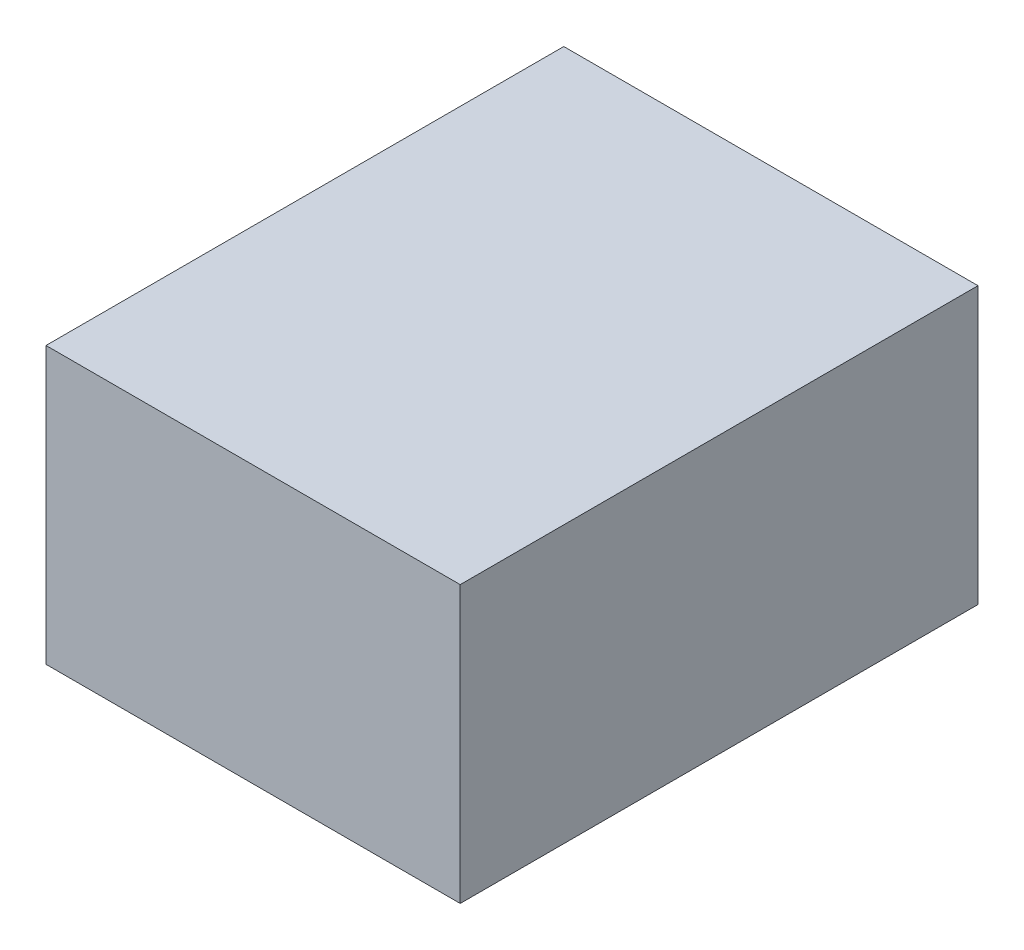
ISO-10303-21;
HEADER;
FILE_DESCRIPTION(('STEP AP214'),'2;1');
FILE_NAME('part.step','',(''),(''),'','','');
FILE_SCHEMA(('AUTOMOTIVE_DESIGN { 1 0 10303 214 1 1 1 1 }'));
ENDSEC;
DATA;
#1=APPLICATION_CONTEXT('core data for automotive mechanical design processes');
#2=APPLICATION_PROTOCOL_DEFINITION('international standard','automotive_design',2000,#1);
#3=PRODUCT_CONTEXT('',#1,'mechanical');
#4=PRODUCT('Part','Part','',(#3));
#5=PRODUCT_RELATED_PRODUCT_CATEGORY('part','',(#4));
#6=PRODUCT_DEFINITION_FORMATION('','',#4);
#7=PRODUCT_DEFINITION_CONTEXT('part definition',#1,'design');
#8=PRODUCT_DEFINITION('design','',#6,#7);
#9=PRODUCT_DEFINITION_SHAPE('','',#8);
#10=(LENGTH_UNIT() NAMED_UNIT(*) SI_UNIT(.MILLI.,.METRE.));
#11=(NAMED_UNIT(*) PLANE_ANGLE_UNIT() SI_UNIT($,.RADIAN.));
#12=(NAMED_UNIT(*) SI_UNIT($,.STERADIAN.) SOLID_ANGLE_UNIT());
#13=UNCERTAINTY_MEASURE_WITH_UNIT(LENGTH_MEASURE(1.E-05),#10,'distance_accuracy_value','');
#14=(GEOMETRIC_REPRESENTATION_CONTEXT(3) GLOBAL_UNCERTAINTY_ASSIGNED_CONTEXT((#13)) GLOBAL_UNIT_ASSIGNED_CONTEXT((#10,
#11,#12)) REPRESENTATION_CONTEXT('',''));
#15=CARTESIAN_POINT('',(0.,0.,0.));
#16=DIRECTION('',(0.,0.,1.));
#17=DIRECTION('',(1.,0.,0.));
#18=AXIS2_PLACEMENT_3D('',#15,#16,#17);
#19=CARTESIAN_POINT('',(0.,0.,190.5));
#20=DIRECTION('',(1.,0.,0.));
#21=DIRECTION('',(0.,0.,-1.));
#22=AXIS2_PLACEMENT_3D('',#19,#20,#21);
#23=PLANE('',#22);
#24=DIRECTION('',(0.,-1.,0.));
#25=VECTOR('',#24,1.);
#26=CARTESIAN_POINT('',(0.,0.,-190.5));
#27=LINE('',#26,#25);
#28=CARTESIAN_POINT('',(0.,203.2,-190.5));
#29=VERTEX_POINT('',#28);
#30=CARTESIAN_POINT('',(0.,0.,-190.5));
#31=VERTEX_POINT('',#30);
#32=EDGE_CURVE('E96',#29,#31,#27,.T.);
#33=ORIENTED_EDGE('',*,*,#32,.T.);
#34=DIRECTION('',(0.,0.,-1.));
#35=VECTOR('',#34,1.);
#36=CARTESIAN_POINT('',(0.,0.,190.5));
#37=LINE('',#36,#35);
#38=CARTESIAN_POINT('',(0.,0.,190.5));
#39=VERTEX_POINT('',#38);
#40=EDGE_CURVE('E11',#39,#31,#37,.T.);
#41=ORIENTED_EDGE('',*,*,#40,.F.);
#42=DIRECTION('',(0.,-1.,0.));
#43=VECTOR('',#42,1.);
#44=CARTESIAN_POINT('',(0.,0.,190.5));
#45=LINE('',#44,#43);
#46=CARTESIAN_POINT('',(0.,203.2,190.5));
#47=VERTEX_POINT('',#46);
#48=EDGE_CURVE('E84',#47,#39,#45,.T.);
#49=ORIENTED_EDGE('',*,*,#48,.F.);
#50=DIRECTION('',(0.,0.,-1.));
#51=VECTOR('',#50,1.);
#52=CARTESIAN_POINT('',(0.,203.2,190.5));
#53=LINE('',#52,#51);
#54=EDGE_CURVE('E92',#47,#29,#53,.T.);
#55=ORIENTED_EDGE('',*,*,#54,.T.);
#56=EDGE_LOOP('',(#33,#41,#49,#55));
#57=FACE_BOUND('',#56,.T.);
#58=ADVANCED_FACE('F33',(#57),#23,.F.);
#59=CARTESIAN_POINT('',(0.,0.,190.5));
#60=DIRECTION('',(0.,1.,0.));
#61=DIRECTION('',(0.,0.,1.));
#62=AXIS2_PLACEMENT_3D('',#59,#60,#61);
#63=PLANE('',#62);
#64=DIRECTION('',(1.,0.,0.));
#65=VECTOR('',#64,1.);
#66=CARTESIAN_POINT('',(0.,0.,-190.5));
#67=LINE('',#66,#65);
#68=CARTESIAN_POINT('',(304.8,0.,-190.5));
#69=VERTEX_POINT('',#68);
#70=EDGE_CURVE('E88',#31,#69,#67,.T.);
#71=ORIENTED_EDGE('',*,*,#70,.T.);
#72=DIRECTION('',(0.,0.,-1.));
#73=VECTOR('',#72,1.);
#74=CARTESIAN_POINT('',(304.8,0.,190.5));
#75=LINE('',#74,#73);
#76=CARTESIAN_POINT('',(304.8,0.,190.5));
#77=VERTEX_POINT('',#76);
#78=EDGE_CURVE('E41',#77,#69,#75,.T.);
#79=ORIENTED_EDGE('',*,*,#78,.F.);
#80=DIRECTION('',(1.,0.,0.));
#81=VECTOR('',#80,1.);
#82=CARTESIAN_POINT('',(0.,0.,190.5));
#83=LINE('',#82,#81);
#84=EDGE_CURVE('E79',#39,#77,#83,.T.);
#85=ORIENTED_EDGE('',*,*,#84,.F.);
#86=ORIENTED_EDGE('',*,*,#40,.T.);
#87=EDGE_LOOP('',(#71,#79,#85,#86));
#88=FACE_BOUND('',#87,.T.);
#89=ADVANCED_FACE('F87',(#88),#63,.F.);
#90=CARTESIAN_POINT('',(304.8,0.,190.5));
#91=DIRECTION('',(-1.,0.,0.));
#92=DIRECTION('',(0.,0.,1.));
#93=AXIS2_PLACEMENT_3D('',#90,#91,#92);
#94=PLANE('',#93);
#95=DIRECTION('',(0.,1.,0.));
#96=VECTOR('',#95,1.);
#97=CARTESIAN_POINT('',(304.8,0.,-190.5));
#98=LINE('',#97,#96);
#99=CARTESIAN_POINT('',(304.8,203.2,-190.5));
#100=VERTEX_POINT('',#99);
#101=EDGE_CURVE('E66',#69,#100,#98,.T.);
#102=ORIENTED_EDGE('',*,*,#101,.T.);
#103=DIRECTION('',(0.,0.,-1.));
#104=VECTOR('',#103,1.);
#105=CARTESIAN_POINT('',(304.8,203.2,190.5));
#106=LINE('',#105,#104);
#107=CARTESIAN_POINT('',(304.8,203.2,190.5));
#108=VERTEX_POINT('',#107);
#109=EDGE_CURVE('E89',#108,#100,#106,.T.);
#110=ORIENTED_EDGE('',*,*,#109,.F.);
#111=DIRECTION('',(0.,1.,0.));
#112=VECTOR('',#111,1.);
#113=CARTESIAN_POINT('',(304.8,0.,190.5));
#114=LINE('',#113,#112);
#115=EDGE_CURVE('E82',#77,#108,#114,.T.);
#116=ORIENTED_EDGE('',*,*,#115,.F.);
#117=ORIENTED_EDGE('',*,*,#78,.T.);
#118=EDGE_LOOP('',(#102,#110,#116,#117));
#119=FACE_BOUND('',#118,.T.);
#120=ADVANCED_FACE('F90',(#119),#94,.F.);
#121=CARTESIAN_POINT('',(0.,203.2,190.5));
#122=DIRECTION('',(0.,-1.,0.));
#123=DIRECTION('',(0.,0.,-1.));
#124=AXIS2_PLACEMENT_3D('',#121,#122,#123);
#125=PLANE('',#124);
#126=DIRECTION('',(-1.,0.,0.));
#127=VECTOR('',#126,1.);
#128=CARTESIAN_POINT('',(0.,203.2,-190.5));
#129=LINE('',#128,#127);
#130=EDGE_CURVE('E72',#100,#29,#129,.T.);
#131=ORIENTED_EDGE('',*,*,#130,.T.);
#132=ORIENTED_EDGE('',*,*,#54,.F.);
#133=DIRECTION('',(-1.,0.,0.));
#134=VECTOR('',#133,1.);
#135=CARTESIAN_POINT('',(0.,203.2,190.5));
#136=LINE('',#135,#134);
#137=EDGE_CURVE('E49',#108,#47,#136,.T.);
#138=ORIENTED_EDGE('',*,*,#137,.F.);
#139=ORIENTED_EDGE('',*,*,#109,.T.);
#140=EDGE_LOOP('',(#131,#132,#138,#139));
#141=FACE_BOUND('',#140,.T.);
#142=ADVANCED_FACE('F103',(#141),#125,.F.);
#143=CARTESIAN_POINT('',(0.,0.,190.5));
#144=DIRECTION('',(0.,0.,-1.));
#145=DIRECTION('',(-1.,0.,0.));
#146=AXIS2_PLACEMENT_3D('',#143,#144,#145);
#147=PLANE('',#146);
#148=ORIENTED_EDGE('',*,*,#48,.T.);
#149=ORIENTED_EDGE('',*,*,#84,.T.);
#150=ORIENTED_EDGE('',*,*,#115,.T.);
#151=ORIENTED_EDGE('',*,*,#137,.T.);
#152=EDGE_LOOP('',(#148,#149,#150,#151));
#153=FACE_BOUND('',#152,.T.);
#154=ADVANCED_FACE('F80',(#153),#147,.F.);
#155=CARTESIAN_POINT('',(0.,0.,-190.5));
#156=DIRECTION('',(0.,0.,-1.));
#157=DIRECTION('',(-1.,0.,0.));
#158=AXIS2_PLACEMENT_3D('',#155,#156,#157);
#159=PLANE('',#158);
#160=ORIENTED_EDGE('',*,*,#32,.F.);
#161=ORIENTED_EDGE('',*,*,#130,.F.);
#162=ORIENTED_EDGE('',*,*,#101,.F.);
#163=ORIENTED_EDGE('',*,*,#70,.F.);
#164=EDGE_LOOP('',(#160,#161,#162,#163));
#165=FACE_BOUND('',#164,.T.);
#166=ADVANCED_FACE('F106',(#165),#159,.T.);
#167=CLOSED_SHELL('',(#58,#89,#120,#142,#154,#166));
#168=MANIFOLD_SOLID_BREP('B2',#167);
#169=ADVANCED_BREP_SHAPE_REPRESENTATION('',(#18,#168),#14);
#170=SHAPE_DEFINITION_REPRESENTATION(#9,#169);
ENDSEC;
END-ISO-10303-21;
